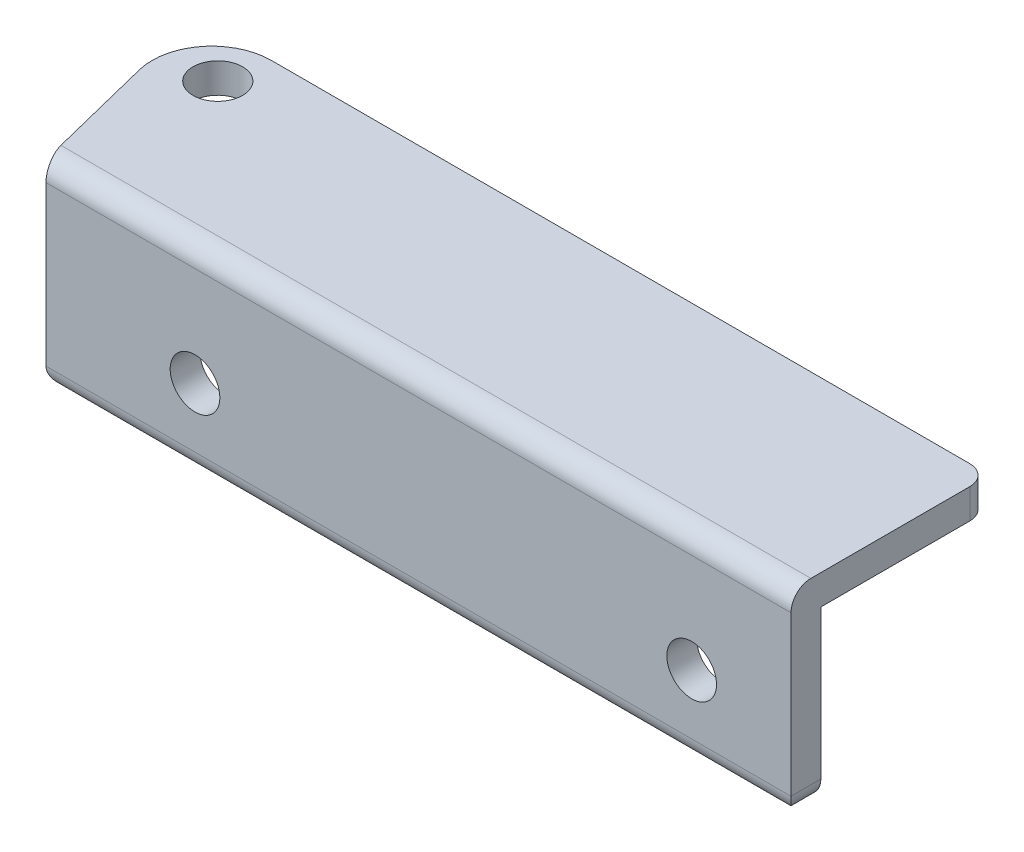
ISO-10303-21;
HEADER;
FILE_DESCRIPTION(('STEP AP214'),'2;1');
FILE_NAME('part.step','',(''),(''),'','','');
FILE_SCHEMA(('AUTOMOTIVE_DESIGN { 1 0 10303 214 1 1 1 1 }'));
ENDSEC;
DATA;
#1=APPLICATION_CONTEXT('core data for automotive mechanical design processes');
#2=APPLICATION_PROTOCOL_DEFINITION('international standard','automotive_design',2000,#1);
#3=PRODUCT_CONTEXT('',#1,'mechanical');
#4=PRODUCT('Part','Part','',(#3));
#5=PRODUCT_RELATED_PRODUCT_CATEGORY('part','',(#4));
#6=PRODUCT_DEFINITION_FORMATION('','',#4);
#7=PRODUCT_DEFINITION_CONTEXT('part definition',#1,'design');
#8=PRODUCT_DEFINITION('design','',#6,#7);
#9=PRODUCT_DEFINITION_SHAPE('','',#8);
#10=(LENGTH_UNIT() NAMED_UNIT(*) SI_UNIT(.MILLI.,.METRE.));
#11=(NAMED_UNIT(*) PLANE_ANGLE_UNIT() SI_UNIT($,.RADIAN.));
#12=(NAMED_UNIT(*) SI_UNIT($,.STERADIAN.) SOLID_ANGLE_UNIT());
#13=UNCERTAINTY_MEASURE_WITH_UNIT(LENGTH_MEASURE(1.E-05),#10,'distance_accuracy_value','');
#14=(GEOMETRIC_REPRESENTATION_CONTEXT(3) GLOBAL_UNCERTAINTY_ASSIGNED_CONTEXT((#13)) GLOBAL_UNIT_ASSIGNED_CONTEXT((#10,
#11,#12)) REPRESENTATION_CONTEXT('',''));
#15=CARTESIAN_POINT('',(0.,0.,0.));
#16=DIRECTION('',(0.,0.,1.));
#17=DIRECTION('',(1.,0.,0.));
#18=AXIS2_PLACEMENT_3D('',#15,#16,#17);
#19=CARTESIAN_POINT('',(0.,20.,0.));
#20=DIRECTION('',(1.,0.,0.));
#21=DIRECTION('',(0.,0.,1.));
#22=AXIS2_PLACEMENT_3D('',#19,#20,#21);
#23=PLANE('',#22);
#24=DIRECTION('',(0.,-1.,0.));
#25=VECTOR('',#24,1.);
#26=CARTESIAN_POINT('',(0.,20.,3.));
#27=LINE('',#26,#25);
#28=CARTESIAN_POINT('',(0.,17.,3.));
#29=VERTEX_POINT('',#28);
#30=CARTESIAN_POINT('',(0.,2.,3.));
#31=VERTEX_POINT('',#30);
#32=EDGE_CURVE('E168',#29,#31,#27,.T.);
#33=ORIENTED_EDGE('',*,*,#32,.F.);
#34=DIRECTION('',(0.,0.,-1.));
#35=VECTOR('',#34,1.);
#36=CARTESIAN_POINT('',(0.,17.,0.));
#37=LINE('',#36,#35);
#38=CARTESIAN_POINT('',(0.,17.,0.));
#39=VERTEX_POINT('',#38);
#40=EDGE_CURVE('E151',#29,#39,#37,.T.);
#41=ORIENTED_EDGE('',*,*,#40,.T.);
#42=DIRECTION('',(0.,-1.,0.));
#43=VECTOR('',#42,1.);
#44=CARTESIAN_POINT('',(0.,20.,0.));
#45=LINE('',#44,#43);
#46=CARTESIAN_POINT('',(0.,2.,0.));
#47=VERTEX_POINT('',#46);
#48=EDGE_CURVE('E145',#39,#47,#45,.T.);
#49=ORIENTED_EDGE('',*,*,#48,.T.);
#50=DIRECTION('',(0.,0.,-1.));
#51=VECTOR('',#50,1.);
#52=CARTESIAN_POINT('',(0.,2.,0.));
#53=LINE('',#52,#51);
#54=EDGE_CURVE('E212',#31,#47,#53,.T.);
#55=ORIENTED_EDGE('',*,*,#54,.F.);
#56=EDGE_LOOP('',(#33,#41,#49,#55));
#57=FACE_BOUND('',#56,.T.);
#58=ADVANCED_FACE('F39',(#57),#23,.F.);
#59=CARTESIAN_POINT('',(0.,20.,0.));
#60=DIRECTION('',(0.,0.,1.));
#61=DIRECTION('',(-1.,0.,0.));
#62=AXIS2_PLACEMENT_3D('',#59,#60,#61);
#63=PLANE('',#62);
#64=CARTESIAN_POINT('',(65.,8.,0.));
#65=DIRECTION('',(0.,0.,1.));
#66=DIRECTION('',(1.,0.,0.));
#67=AXIS2_PLACEMENT_3D('',#64,#65,#66);
#68=CIRCLE('',#67,2.49999999999999);
#69=CARTESIAN_POINT('',(67.5,8.,0.));
#70=VERTEX_POINT('',#69);
#71=EDGE_CURVE('E259',#70,#70,#68,.T.);
#72=ORIENTED_EDGE('',*,*,#71,.T.);
#73=EDGE_LOOP('',(#72));
#74=FACE_BOUND('',#73,.T.);
#75=CARTESIAN_POINT('',(15.,8.,0.));
#76=DIRECTION('',(0.,0.,1.));
#77=DIRECTION('',(1.,0.,0.));
#78=AXIS2_PLACEMENT_3D('',#75,#76,#77);
#79=CIRCLE('',#78,2.5);
#80=CARTESIAN_POINT('',(17.5,8.,0.));
#81=VERTEX_POINT('',#80);
#82=EDGE_CURVE('E256',#81,#81,#79,.T.);
#83=ORIENTED_EDGE('',*,*,#82,.T.);
#84=EDGE_LOOP('',(#83));
#85=FACE_BOUND('',#84,.T.);
#86=ORIENTED_EDGE('',*,*,#48,.F.);
#87=DIRECTION('',(1.,0.,0.));
#88=VECTOR('',#87,1.);
#89=CARTESIAN_POINT('',(0.,17.,0.));
#90=LINE('',#89,#88);
#91=CARTESIAN_POINT('',(75.,17.,0.));
#92=VERTEX_POINT('',#91);
#93=EDGE_CURVE('E131',#39,#92,#90,.T.);
#94=ORIENTED_EDGE('',*,*,#93,.T.);
#95=DIRECTION('',(0.,-1.,0.));
#96=VECTOR('',#95,1.);
#97=CARTESIAN_POINT('',(75.,20.,0.));
#98=LINE('',#97,#96);
#99=CARTESIAN_POINT('',(75.,2.,0.));
#100=VERTEX_POINT('',#99);
#101=EDGE_CURVE('E138',#92,#100,#98,.T.);
#102=ORIENTED_EDGE('',*,*,#101,.T.);
#103=CARTESIAN_POINT('',(73.,2.,0.));
#104=DIRECTION('',(0.,0.,-1.));
#105=DIRECTION('',(-1.,0.,0.));
#106=AXIS2_PLACEMENT_3D('',#103,#104,#105);
#107=CIRCLE('',#106,2.);
#108=CARTESIAN_POINT('',(73.,0.,0.));
#109=VERTEX_POINT('',#108);
#110=EDGE_CURVE('E214',#109,#100,#107,.F.);
#111=ORIENTED_EDGE('',*,*,#110,.F.);
#112=DIRECTION('',(1.,0.,0.));
#113=VECTOR('',#112,1.);
#114=CARTESIAN_POINT('',(0.,0.,0.));
#115=LINE('',#114,#113);
#116=CARTESIAN_POINT('',(2.,0.,0.));
#117=VERTEX_POINT('',#116);
#118=EDGE_CURVE('E153',#117,#109,#115,.T.);
#119=ORIENTED_EDGE('',*,*,#118,.F.);
#120=CARTESIAN_POINT('',(2.,2.,0.));
#121=DIRECTION('',(0.,0.,-1.));
#122=DIRECTION('',(-1.,0.,0.));
#123=AXIS2_PLACEMENT_3D('',#120,#121,#122);
#124=CIRCLE('',#123,2.);
#125=EDGE_CURVE('E62',#47,#117,#124,.F.);
#126=ORIENTED_EDGE('',*,*,#125,.F.);
#127=EDGE_LOOP('',(#86,#94,#102,#111,#119,#126));
#128=FACE_BOUND('',#127,.T.);
#129=ADVANCED_FACE('F148',(#74,#85,#128),#63,.F.);
#130=CARTESIAN_POINT('',(75.,20.,0.));
#131=DIRECTION('',(-1.,0.,0.));
#132=DIRECTION('',(0.,0.,-1.));
#133=AXIS2_PLACEMENT_3D('',#130,#131,#132);
#134=PLANE('',#133);
#135=DIRECTION('',(0.,-1.,0.));
#136=VECTOR('',#135,1.);
#137=CARTESIAN_POINT('',(75.,20.,3.));
#138=LINE('',#137,#136);
#139=CARTESIAN_POINT('',(75.,18.,3.));
#140=VERTEX_POINT('',#139);
#141=CARTESIAN_POINT('',(75.,2.,3.));
#142=VERTEX_POINT('',#141);
#143=EDGE_CURVE('E146',#140,#142,#138,.T.);
#144=ORIENTED_EDGE('',*,*,#143,.T.);
#145=DIRECTION('',(0.,0.,1.));
#146=VECTOR('',#145,1.);
#147=CARTESIAN_POINT('',(75.,2.,3.));
#148=LINE('',#147,#146);
#149=EDGE_CURVE('E142',#100,#142,#148,.T.);
#150=ORIENTED_EDGE('',*,*,#149,.F.);
#151=ORIENTED_EDGE('',*,*,#101,.F.);
#152=DIRECTION('',(0.,0.,-1.));
#153=VECTOR('',#152,1.);
#154=CARTESIAN_POINT('',(75.,17.,0.));
#155=LINE('',#154,#153);
#156=CARTESIAN_POINT('',(75.,17.,-15.));
#157=VERTEX_POINT('',#156);
#158=EDGE_CURVE('E126',#92,#157,#155,.T.);
#159=ORIENTED_EDGE('',*,*,#158,.T.);
#160=DIRECTION('',(0.,1.,0.));
#161=VECTOR('',#160,1.);
#162=CARTESIAN_POINT('',(75.,17.,-15.));
#163=LINE('',#162,#161);
#164=CARTESIAN_POINT('',(75.,20.,-15.));
#165=VERTEX_POINT('',#164);
#166=EDGE_CURVE('E206',#165,#157,#163,.F.);
#167=ORIENTED_EDGE('',*,*,#166,.F.);
#168=DIRECTION('',(0.,0.,1.));
#169=VECTOR('',#168,1.);
#170=CARTESIAN_POINT('',(75.,20.,0.));
#171=LINE('',#170,#169);
#172=CARTESIAN_POINT('',(75.,20.,1.));
#173=VERTEX_POINT('',#172);
#174=EDGE_CURVE('E165',#165,#173,#171,.T.);
#175=ORIENTED_EDGE('',*,*,#174,.T.);
#176=CARTESIAN_POINT('',(75.,18.,1.));
#177=DIRECTION('',(1.,0.,0.));
#178=DIRECTION('',(0.,0.,-1.));
#179=AXIS2_PLACEMENT_3D('',#176,#177,#178);
#180=CIRCLE('',#179,2.);
#181=EDGE_CURVE('E209',#140,#173,#180,.F.);
#182=ORIENTED_EDGE('',*,*,#181,.F.);
#183=EDGE_LOOP('',(#144,#150,#151,#159,#167,#175,#182));
#184=FACE_BOUND('',#183,.T.);
#185=ADVANCED_FACE('F140',(#184),#134,.F.);
#186=CARTESIAN_POINT('',(0.,20.,3.));
#187=DIRECTION('',(0.,0.,-1.));
#188=DIRECTION('',(1.,0.,0.));
#189=AXIS2_PLACEMENT_3D('',#186,#187,#188);
#190=PLANE('',#189);
#191=CARTESIAN_POINT('',(65.,8.,3.));
#192=DIRECTION('',(0.,0.,1.));
#193=DIRECTION('',(1.,0.,0.));
#194=AXIS2_PLACEMENT_3D('',#191,#192,#193);
#195=CIRCLE('',#194,2.49999999999999);
#196=CARTESIAN_POINT('',(67.5,8.,3.));
#197=VERTEX_POINT('',#196);
#198=EDGE_CURVE('E252',#197,#197,#195,.T.);
#199=ORIENTED_EDGE('',*,*,#198,.F.);
#200=EDGE_LOOP('',(#199));
#201=FACE_BOUND('',#200,.T.);
#202=CARTESIAN_POINT('',(15.,8.,3.));
#203=DIRECTION('',(0.,0.,1.));
#204=DIRECTION('',(1.,0.,0.));
#205=AXIS2_PLACEMENT_3D('',#202,#203,#204);
#206=CIRCLE('',#205,2.5);
#207=CARTESIAN_POINT('',(17.5,8.,3.));
#208=VERTEX_POINT('',#207);
#209=EDGE_CURVE('E253',#208,#208,#206,.T.);
#210=ORIENTED_EDGE('',*,*,#209,.F.);
#211=EDGE_LOOP('',(#210));
#212=FACE_BOUND('',#211,.T.);
#213=ORIENTED_EDGE('',*,*,#143,.F.);
#214=DIRECTION('',(-1.,0.,0.));
#215=VECTOR('',#214,1.);
#216=CARTESIAN_POINT('',(0.,18.,3.));
#217=LINE('',#216,#215);
#218=CARTESIAN_POINT('',(0.,18.,3.));
#219=VERTEX_POINT('',#218);
#220=EDGE_CURVE('E186',#219,#140,#217,.F.);
#221=ORIENTED_EDGE('',*,*,#220,.F.);
#222=EDGE_CURVE('E171',#219,#29,#27,.T.);
#223=ORIENTED_EDGE('',*,*,#222,.T.);
#224=ORIENTED_EDGE('',*,*,#32,.T.);
#225=DIRECTION('',(-1.,0.,0.));
#226=VECTOR('',#225,1.);
#227=CARTESIAN_POINT('',(0.,2.,3.));
#228=LINE('',#227,#226);
#229=EDGE_CURVE('E188',#142,#31,#228,.T.);
#230=ORIENTED_EDGE('',*,*,#229,.F.);
#231=EDGE_LOOP('',(#213,#221,#223,#224,#230));
#232=FACE_BOUND('',#231,.T.);
#233=ADVANCED_FACE('F268',(#201,#212,#232),#190,.F.);
#234=CARTESIAN_POINT('',(0.,20.,0.));
#235=DIRECTION('',(0.,-1.,0.));
#236=DIRECTION('',(0.,0.,1.));
#237=AXIS2_PLACEMENT_3D('',#234,#235,#236);
#238=PLANE('',#237);
#239=CARTESIAN_POINT('',(1.79427023522428,20.,-12.5));
#240=DIRECTION('',(0.,-1.,0.));
#241=DIRECTION('',(0.,0.,-1.));
#242=AXIS2_PLACEMENT_3D('',#239,#240,#241);
#243=CIRCLE('',#242,2.5);
#244=CARTESIAN_POINT('',(1.79427023522428,20.,-15.));
#245=VERTEX_POINT('',#244);
#246=EDGE_CURVE('E249',#245,#245,#243,.T.);
#247=ORIENTED_EDGE('',*,*,#246,.T.);
#248=EDGE_LOOP('',(#247));
#249=FACE_BOUND('',#248,.T.);
#250=ORIENTED_EDGE('',*,*,#174,.F.);
#251=CARTESIAN_POINT('',(73.,20.,-15.));
#252=DIRECTION('',(0.,1.,0.));
#253=DIRECTION('',(0.,0.,1.));
#254=AXIS2_PLACEMENT_3D('',#251,#252,#253);
#255=CIRCLE('',#254,2.);
#256=CARTESIAN_POINT('',(73.,20.,-17.));
#257=VERTEX_POINT('',#256);
#258=EDGE_CURVE('E199',#257,#165,#255,.F.);
#259=ORIENTED_EDGE('',*,*,#258,.F.);
#260=DIRECTION('',(1.,0.,0.));
#261=VECTOR('',#260,1.);
#262=CARTESIAN_POINT('',(0.,20.,-17.));
#263=LINE('',#262,#261);
#264=CARTESIAN_POINT('',(2.68465843842649,20.,-17.));
#265=VERTEX_POINT('',#264);
#266=EDGE_CURVE('E160',#265,#257,#263,.T.);
#267=ORIENTED_EDGE('',*,*,#266,.F.);
#268=CARTESIAN_POINT('',(2.68465843842649,20.,-11.));
#269=DIRECTION('',(0.,1.,0.));
#270=DIRECTION('',(0.,0.,1.));
#271=AXIS2_PLACEMENT_3D('',#268,#269,#270);
#272=CIRCLE('',#271,6.);
#273=CARTESIAN_POINT('',(-3.1361965624455,20.,-9.544786249782));
#274=VERTEX_POINT('',#273);
#275=EDGE_CURVE('E178',#274,#265,#272,.F.);
#276=ORIENTED_EDGE('',*,*,#275,.F.);
#277=DIRECTION('',(-0.242535625036333,0.,-0.970142500145332));
#278=VECTOR('',#277,1.);
#279=CARTESIAN_POINT('',(-0.705882352941176,20.,0.176470588235294));
#280=LINE('',#279,#278);
#281=CARTESIAN_POINT('',(-0.5,20.,1.));
#282=VERTEX_POINT('',#281);
#283=EDGE_CURVE('E157',#282,#274,#280,.T.);
#284=ORIENTED_EDGE('',*,*,#283,.F.);
#285=DIRECTION('',(-1.,0.,0.));
#286=VECTOR('',#285,1.);
#287=CARTESIAN_POINT('',(0.,20.,1.));
#288=LINE('',#287,#286);
#289=EDGE_CURVE('E201',#173,#282,#288,.T.);
#290=ORIENTED_EDGE('',*,*,#289,.F.);
#291=EDGE_LOOP('',(#250,#259,#267,#276,#284,#290));
#292=FACE_BOUND('',#291,.T.);
#293=ADVANCED_FACE('F271',(#249,#292),#238,.F.);
#294=CARTESIAN_POINT('',(0.,0.,0.));
#295=DIRECTION('',(0.,-1.,0.));
#296=DIRECTION('',(0.,0.,1.));
#297=AXIS2_PLACEMENT_3D('',#294,#295,#296);
#298=PLANE('',#297);
#299=ORIENTED_EDGE('',*,*,#118,.T.);
#300=DIRECTION('',(0.,0.,1.));
#301=VECTOR('',#300,1.);
#302=CARTESIAN_POINT('',(73.,0.,0.));
#303=LINE('',#302,#301);
#304=CARTESIAN_POINT('',(73.,0.,1.));
#305=VERTEX_POINT('',#304);
#306=EDGE_CURVE('E191',#305,#109,#303,.F.);
#307=ORIENTED_EDGE('',*,*,#306,.F.);
#308=DIRECTION('',(-1.,0.,0.));
#309=VECTOR('',#308,1.);
#310=CARTESIAN_POINT('',(75.,0.,1.));
#311=LINE('',#310,#309);
#312=CARTESIAN_POINT('',(2.,0.,1.));
#313=VERTEX_POINT('',#312);
#314=EDGE_CURVE('E193',#313,#305,#311,.F.);
#315=ORIENTED_EDGE('',*,*,#314,.F.);
#316=DIRECTION('',(0.,0.,-1.));
#317=VECTOR('',#316,1.);
#318=CARTESIAN_POINT('',(2.,0.,3.));
#319=LINE('',#318,#317);
#320=EDGE_CURVE('E196',#117,#313,#319,.F.);
#321=ORIENTED_EDGE('',*,*,#320,.F.);
#322=EDGE_LOOP('',(#299,#307,#315,#321));
#323=FACE_BOUND('',#322,.T.);
#324=ADVANCED_FACE('F227',(#323),#298,.T.);
#325=CARTESIAN_POINT('',(-0.705882352941176,17.,0.176470588235294));
#326=DIRECTION('',(-0.970142500145332,0.,0.242535625036333));
#327=DIRECTION('',(-0.242535625036333,0.,-0.970142500145332));
#328=AXIS2_PLACEMENT_3D('',#325,#326,#327);
#329=PLANE('',#328);
#330=ORIENTED_EDGE('',*,*,#283,.T.);
#331=DIRECTION('',(0.,1.,0.));
#332=VECTOR('',#331,1.);
#333=CARTESIAN_POINT('',(-3.1361965624455,17.,-9.544786249782));
#334=LINE('',#333,#332);
#335=CARTESIAN_POINT('',(-3.1361965624455,17.,-9.544786249782));
#336=VERTEX_POINT('',#335);
#337=EDGE_CURVE('E176',#336,#274,#334,.T.);
#338=ORIENTED_EDGE('',*,*,#337,.F.);
#339=DIRECTION('',(-0.242535625036333,0.,-0.970142500145332));
#340=VECTOR('',#339,1.);
#341=CARTESIAN_POINT('',(-0.705882352941176,17.,0.176470588235294));
#342=LINE('',#341,#340);
#343=EDGE_CURVE('E164',#29,#336,#342,.T.);
#344=ORIENTED_EDGE('',*,*,#343,.F.);
#345=ORIENTED_EDGE('',*,*,#222,.F.);
#346=CARTESIAN_POINT('',(-0.5,18.,1.));
#347=DIRECTION('',(0.970142500145332,0.,-0.242535625036333));
#348=DIRECTION('',(-0.242535625036333,0.,-0.970142500145332));
#349=AXIS2_PLACEMENT_3D('',#346,#347,#348);
#350=ELLIPSE('',#349,2.06155281280883,2.);
#351=EDGE_CURVE('E204',#282,#219,#350,.T.);
#352=ORIENTED_EDGE('',*,*,#351,.F.);
#353=EDGE_LOOP('',(#330,#338,#344,#345,#352));
#354=FACE_BOUND('',#353,.T.);
#355=ADVANCED_FACE('F239',(#354),#329,.T.);
#356=CARTESIAN_POINT('',(0.,17.,-17.));
#357=DIRECTION('',(0.,0.,-1.));
#358=DIRECTION('',(1.,0.,0.));
#359=AXIS2_PLACEMENT_3D('',#356,#357,#358);
#360=PLANE('',#359);
#361=DIRECTION('',(1.,0.,0.));
#362=VECTOR('',#361,1.);
#363=CARTESIAN_POINT('',(0.,17.,-17.));
#364=LINE('',#363,#362);
#365=CARTESIAN_POINT('',(2.68465843842649,17.,-17.));
#366=VERTEX_POINT('',#365);
#367=CARTESIAN_POINT('',(73.,17.,-17.));
#368=VERTEX_POINT('',#367);
#369=EDGE_CURVE('E135',#366,#368,#364,.T.);
#370=ORIENTED_EDGE('',*,*,#369,.F.);
#371=DIRECTION('',(0.,1.,0.));
#372=VECTOR('',#371,1.);
#373=CARTESIAN_POINT('',(2.68465843842649,17.,-17.));
#374=LINE('',#373,#372);
#375=EDGE_CURVE('E181',#265,#366,#374,.F.);
#376=ORIENTED_EDGE('',*,*,#375,.F.);
#377=ORIENTED_EDGE('',*,*,#266,.T.);
#378=DIRECTION('',(0.,1.,0.));
#379=VECTOR('',#378,1.);
#380=CARTESIAN_POINT('',(73.,20.,-17.));
#381=LINE('',#380,#379);
#382=EDGE_CURVE('E48',#368,#257,#381,.T.);
#383=ORIENTED_EDGE('',*,*,#382,.F.);
#384=EDGE_LOOP('',(#370,#376,#377,#383));
#385=FACE_BOUND('',#384,.T.);
#386=ADVANCED_FACE('F247',(#385),#360,.T.);
#387=CARTESIAN_POINT('',(0.,17.,0.));
#388=DIRECTION('',(0.,1.,0.));
#389=DIRECTION('',(0.,0.,-1.));
#390=AXIS2_PLACEMENT_3D('',#387,#388,#389);
#391=PLANE('',#390);
#392=CARTESIAN_POINT('',(1.79427023522428,17.,-12.5));
#393=DIRECTION('',(0.,-1.,0.));
#394=DIRECTION('',(0.,0.,-1.));
#395=AXIS2_PLACEMENT_3D('',#392,#393,#394);
#396=CIRCLE('',#395,2.5);
#397=CARTESIAN_POINT('',(1.79427023522428,17.,-15.));
#398=VERTEX_POINT('',#397);
#399=EDGE_CURVE('E43',#398,#398,#396,.T.);
#400=ORIENTED_EDGE('',*,*,#399,.F.);
#401=EDGE_LOOP('',(#400));
#402=FACE_BOUND('',#401,.T.);
#403=ORIENTED_EDGE('',*,*,#158,.F.);
#404=ORIENTED_EDGE('',*,*,#93,.F.);
#405=ORIENTED_EDGE('',*,*,#40,.F.);
#406=ORIENTED_EDGE('',*,*,#343,.T.);
#407=CARTESIAN_POINT('',(2.68465843842649,17.,-11.));
#408=DIRECTION('',(0.,-1.,0.));
#409=DIRECTION('',(0.,0.,-1.));
#410=AXIS2_PLACEMENT_3D('',#407,#408,#409);
#411=CIRCLE('',#410,6.);
#412=EDGE_CURVE('E184',#366,#336,#411,.F.);
#413=ORIENTED_EDGE('',*,*,#412,.F.);
#414=ORIENTED_EDGE('',*,*,#369,.T.);
#415=CARTESIAN_POINT('',(73.,17.,-15.));
#416=DIRECTION('',(0.,-1.,0.));
#417=DIRECTION('',(0.,0.,-1.));
#418=AXIS2_PLACEMENT_3D('',#415,#416,#417);
#419=CIRCLE('',#418,2.);
#420=EDGE_CURVE('E11',#157,#368,#419,.F.);
#421=ORIENTED_EDGE('',*,*,#420,.F.);
#422=EDGE_LOOP('',(#403,#404,#405,#406,#413,#414,#421));
#423=FACE_BOUND('',#422,.T.);
#424=ADVANCED_FACE('F128',(#402,#423),#391,.F.);
#425=CARTESIAN_POINT('',(2.68465843842649,17.,-11.));
#426=DIRECTION('',(0.,1.,0.));
#427=DIRECTION('',(0.,0.,-1.));
#428=AXIS2_PLACEMENT_3D('',#425,#426,#427);
#429=CYLINDRICAL_SURFACE('',#428,6.);
#430=ORIENTED_EDGE('',*,*,#412,.T.);
#431=ORIENTED_EDGE('',*,*,#337,.T.);
#432=ORIENTED_EDGE('',*,*,#275,.T.);
#433=ORIENTED_EDGE('',*,*,#375,.T.);
#434=EDGE_LOOP('',(#430,#431,#432,#433));
#435=FACE_BOUND('',#434,.T.);
#436=ADVANCED_FACE('F243',(#435),#429,.T.);
#437=CARTESIAN_POINT('',(73.,2.,0.));
#438=DIRECTION('',(0.,0.,-1.));
#439=DIRECTION('',(1.,0.,0.));
#440=AXIS2_PLACEMENT_3D('',#437,#438,#439);
#441=CYLINDRICAL_SURFACE('',#440,2.);
#442=ORIENTED_EDGE('',*,*,#110,.T.);
#443=ORIENTED_EDGE('',*,*,#149,.T.);
#444=CARTESIAN_POINT('',(73.,2.,1.));
#445=DIRECTION('',(-0.707106781186547,0.,0.707106781186547));
#446=DIRECTION('',(-0.707106781186547,0.,-0.707106781186547));
#447=AXIS2_PLACEMENT_3D('',#444,#445,#446);
#448=ELLIPSE('',#447,2.82842712474619,2.);
#449=EDGE_CURVE('E161',#142,#305,#448,.F.);
#450=ORIENTED_EDGE('',*,*,#449,.T.);
#451=ORIENTED_EDGE('',*,*,#306,.T.);
#452=EDGE_LOOP('',(#442,#443,#450,#451));
#453=FACE_BOUND('',#452,.T.);
#454=ADVANCED_FACE('F220',(#453),#441,.T.);
#455=CARTESIAN_POINT('',(2.,2.,0.));
#456=DIRECTION('',(0.,0.,1.));
#457=DIRECTION('',(-1.,0.,0.));
#458=AXIS2_PLACEMENT_3D('',#455,#456,#457);
#459=CYLINDRICAL_SURFACE('',#458,2.);
#460=ORIENTED_EDGE('',*,*,#125,.T.);
#461=ORIENTED_EDGE('',*,*,#320,.T.);
#462=CARTESIAN_POINT('',(2.,2.,1.));
#463=DIRECTION('',(-0.707106781186547,0.,-0.707106781186547));
#464=DIRECTION('',(-0.707106781186547,0.,0.707106781186547));
#465=AXIS2_PLACEMENT_3D('',#462,#463,#464);
#466=ELLIPSE('',#465,2.82842712474619,2.);
#467=EDGE_CURVE('E218',#313,#31,#466,.T.);
#468=ORIENTED_EDGE('',*,*,#467,.T.);
#469=ORIENTED_EDGE('',*,*,#54,.T.);
#470=EDGE_LOOP('',(#460,#461,#468,#469));
#471=FACE_BOUND('',#470,.T.);
#472=ADVANCED_FACE('F229',(#471),#459,.T.);
#473=CARTESIAN_POINT('',(0.,2.,1.));
#474=DIRECTION('',(1.,0.,0.));
#475=DIRECTION('',(0.,0.,1.));
#476=AXIS2_PLACEMENT_3D('',#473,#474,#475);
#477=CYLINDRICAL_SURFACE('',#476,2.);
#478=ORIENTED_EDGE('',*,*,#449,.F.);
#479=ORIENTED_EDGE('',*,*,#229,.T.);
#480=ORIENTED_EDGE('',*,*,#467,.F.);
#481=ORIENTED_EDGE('',*,*,#314,.T.);
#482=EDGE_LOOP('',(#478,#479,#480,#481));
#483=FACE_BOUND('',#482,.T.);
#484=ADVANCED_FACE('F225',(#483),#477,.T.);
#485=CARTESIAN_POINT('',(0.,18.,1.));
#486=DIRECTION('',(-1.,0.,0.));
#487=DIRECTION('',(0.,0.,-1.));
#488=AXIS2_PLACEMENT_3D('',#485,#486,#487);
#489=CYLINDRICAL_SURFACE('',#488,2.);
#490=ORIENTED_EDGE('',*,*,#181,.T.);
#491=ORIENTED_EDGE('',*,*,#289,.T.);
#492=ORIENTED_EDGE('',*,*,#351,.T.);
#493=ORIENTED_EDGE('',*,*,#220,.T.);
#494=EDGE_LOOP('',(#490,#491,#492,#493));
#495=FACE_BOUND('',#494,.T.);
#496=ADVANCED_FACE('F280',(#495),#489,.T.);
#497=CARTESIAN_POINT('',(73.,17.,-15.));
#498=DIRECTION('',(0.,-1.,0.));
#499=DIRECTION('',(0.,0.,1.));
#500=AXIS2_PLACEMENT_3D('',#497,#498,#499);
#501=CYLINDRICAL_SURFACE('',#500,2.);
#502=ORIENTED_EDGE('',*,*,#420,.T.);
#503=ORIENTED_EDGE('',*,*,#382,.T.);
#504=ORIENTED_EDGE('',*,*,#258,.T.);
#505=ORIENTED_EDGE('',*,*,#166,.T.);
#506=EDGE_LOOP('',(#502,#503,#504,#505));
#507=FACE_BOUND('',#506,.T.);
#508=ADVANCED_FACE('F41',(#507),#501,.T.);
#509=CARTESIAN_POINT('',(1.79427023522428,0.,-12.5));
#510=DIRECTION('',(0.,1.,0.));
#511=DIRECTION('',(0.,0.,-1.));
#512=AXIS2_PLACEMENT_3D('',#509,#510,#511);
#513=CYLINDRICAL_SURFACE('',#512,2.5);
#514=ORIENTED_EDGE('',*,*,#246,.F.);
#515=EDGE_LOOP('',(#514));
#516=FACE_BOUND('',#515,.T.);
#517=ORIENTED_EDGE('',*,*,#399,.T.);
#518=EDGE_LOOP('',(#517));
#519=FACE_BOUND('',#518,.T.);
#520=ADVANCED_FACE('F284',(#516,#519),#513,.F.);
#521=CARTESIAN_POINT('',(15.,8.,3.));
#522=DIRECTION('',(0.,0.,-1.));
#523=DIRECTION('',(1.,0.,0.));
#524=AXIS2_PLACEMENT_3D('',#521,#522,#523);
#525=CYLINDRICAL_SURFACE('',#524,2.5);
#526=CARTESIAN_POINT('',(17.5,8.,3.));
#527=CARTESIAN_POINT('',(17.5,8.,2.96875));
#528=CARTESIAN_POINT('',(17.5,8.,2.9375));
#529=CARTESIAN_POINT('',(17.5,8.,2.875));
#530=CARTESIAN_POINT('',(17.5,8.,2.84375));
#531=CARTESIAN_POINT('',(17.5,8.,2.78125));
#532=CARTESIAN_POINT('',(17.5,8.,2.75));
#533=CARTESIAN_POINT('',(17.5,8.,2.6875));
#534=CARTESIAN_POINT('',(17.5,8.,2.65625));
#535=CARTESIAN_POINT('',(17.5,8.,2.59375));
#536=CARTESIAN_POINT('',(17.5,8.,2.5625));
#537=CARTESIAN_POINT('',(17.5,8.,2.5));
#538=CARTESIAN_POINT('',(17.5,8.,2.46875));
#539=CARTESIAN_POINT('',(17.5,8.,2.40625));
#540=CARTESIAN_POINT('',(17.5,8.,2.375));
#541=CARTESIAN_POINT('',(17.5,8.,2.3125));
#542=CARTESIAN_POINT('',(17.5,8.,2.28125));
#543=CARTESIAN_POINT('',(17.5,8.,2.21875));
#544=CARTESIAN_POINT('',(17.5,8.,2.1875));
#545=CARTESIAN_POINT('',(17.5,8.,2.125));
#546=CARTESIAN_POINT('',(17.5,8.,2.09375));
#547=CARTESIAN_POINT('',(17.5,8.,2.03125));
#548=CARTESIAN_POINT('',(17.5,8.,2.));
#549=CARTESIAN_POINT('',(17.5,8.,1.9375));
#550=CARTESIAN_POINT('',(17.5,8.,1.90625));
#551=CARTESIAN_POINT('',(17.5,8.,1.84375));
#552=CARTESIAN_POINT('',(17.5,8.,1.8125));
#553=CARTESIAN_POINT('',(17.5,8.,1.75));
#554=CARTESIAN_POINT('',(17.5,8.,1.71875));
#555=CARTESIAN_POINT('',(17.5,8.,1.65625));
#556=CARTESIAN_POINT('',(17.5,8.,1.625));
#557=CARTESIAN_POINT('',(17.5,8.,1.5625));
#558=CARTESIAN_POINT('',(17.5,8.,1.53125));
#559=CARTESIAN_POINT('',(17.5,8.,1.46875));
#560=CARTESIAN_POINT('',(17.5,8.,1.4375));
#561=CARTESIAN_POINT('',(17.5,8.,1.375));
#562=CARTESIAN_POINT('',(17.5,8.,1.34375));
#563=CARTESIAN_POINT('',(17.5,8.,1.28125));
#564=CARTESIAN_POINT('',(17.5,8.,1.25));
#565=CARTESIAN_POINT('',(17.5,8.,1.1875));
#566=CARTESIAN_POINT('',(17.5,8.,1.15625));
#567=CARTESIAN_POINT('',(17.5,8.,1.09375));
#568=CARTESIAN_POINT('',(17.5,8.,1.0625));
#569=CARTESIAN_POINT('',(17.5,8.,1.));
#570=CARTESIAN_POINT('',(17.5,8.,0.96875));
#571=CARTESIAN_POINT('',(17.5,8.,0.90625));
#572=CARTESIAN_POINT('',(17.5,8.,0.875));
#573=CARTESIAN_POINT('',(17.5,8.,0.8125));
#574=CARTESIAN_POINT('',(17.5,8.,0.78125));
#575=CARTESIAN_POINT('',(17.5,8.,0.71875));
#576=CARTESIAN_POINT('',(17.5,8.,0.6875));
#577=CARTESIAN_POINT('',(17.5,8.,0.625));
#578=CARTESIAN_POINT('',(17.5,8.,0.59375));
#579=CARTESIAN_POINT('',(17.5,8.,0.53125));
#580=CARTESIAN_POINT('',(17.5,8.,0.5));
#581=CARTESIAN_POINT('',(17.5,8.,0.4375));
#582=CARTESIAN_POINT('',(17.5,8.,0.40625));
#583=CARTESIAN_POINT('',(17.5,8.,0.34375));
#584=CARTESIAN_POINT('',(17.5,8.,0.3125));
#585=CARTESIAN_POINT('',(17.5,8.,0.25));
#586=CARTESIAN_POINT('',(17.5,8.,0.21875));
#587=CARTESIAN_POINT('',(17.5,8.,0.15625));
#588=CARTESIAN_POINT('',(17.5,8.,0.125));
#589=CARTESIAN_POINT('',(17.5,8.,0.0625000000000001));
#590=CARTESIAN_POINT('',(17.5,8.,0.03125));
#591=CARTESIAN_POINT('',(17.5,8.,0.));
#592=B_SPLINE_CURVE_WITH_KNOTS('',3,(#526,#527,#528,#529,#530,#531,#532,#533,#534,#535,#536,
#537,#538,#539,#540,#541,#542,#543,#544,#545,#546,#547,#548,#549,#550,#551,#552,#553,#554,#555,
#556,#557,#558,#559,#560,#561,#562,#563,#564,#565,#566,#567,#568,#569,#570,#571,#572,#573,#574,
#575,#576,#577,#578,#579,#580,#581,#582,#583,#584,#585,#586,#587,#588,#589,#590,#591),
.UNSPECIFIED.,.F.,.F.,(4,2,2,2,2,2,2,2,2,2,2,2,2,2,2,2,2,2,2,2,2,2,2,2,2,2,2,2,2,2,2,2,4),(0.,
0.0937499999999997,0.1875,0.28125,0.375,0.46875,0.5625,0.65625,0.75,0.84375,0.9375,1.03125,
1.125,1.21875,1.3125,1.40625,1.5,1.59375,1.6875,1.78125,1.875,1.96875,2.0625,2.15625,2.25,
2.34375,2.4375,2.53125,2.625,2.71875,2.8125,2.90625,3.),.UNSPECIFIED.);
#593=EDGE_CURVE('BSEAM289',#208,#81,#592,.T.);
#594=ORIENTED_EDGE('',*,*,#209,.T.);
#595=ORIENTED_EDGE('',*,*,#82,.F.);
#596=ORIENTED_EDGE('',*,*,#593,.T.);
#597=ORIENTED_EDGE('',*,*,#593,.F.);
#598=EDGE_LOOP('',(#594,#596,#595,#597));
#599=FACE_BOUND('',#598,.T.);
#600=ADVANCED_FACE('F289',(#599),#525,.F.);
#601=CARTESIAN_POINT('',(65.,8.,3.));
#602=DIRECTION('',(0.,0.,-1.));
#603=DIRECTION('',(1.,0.,0.));
#604=AXIS2_PLACEMENT_3D('',#601,#602,#603);
#605=CYLINDRICAL_SURFACE('',#604,2.49999999999999);
#606=CARTESIAN_POINT('',(67.5,8.,3.));
#607=CARTESIAN_POINT('',(67.5,8.,2.96875));
#608=CARTESIAN_POINT('',(67.5,8.,2.9375));
#609=CARTESIAN_POINT('',(67.5,8.,2.875));
#610=CARTESIAN_POINT('',(67.5,8.,2.84375));
#611=CARTESIAN_POINT('',(67.5,8.,2.78125));
#612=CARTESIAN_POINT('',(67.5,8.,2.75));
#613=CARTESIAN_POINT('',(67.5,8.,2.6875));
#614=CARTESIAN_POINT('',(67.5,8.,2.65625));
#615=CARTESIAN_POINT('',(67.5,8.,2.59375));
#616=CARTESIAN_POINT('',(67.5,8.,2.5625));
#617=CARTESIAN_POINT('',(67.5,8.,2.5));
#618=CARTESIAN_POINT('',(67.5,8.,2.46875));
#619=CARTESIAN_POINT('',(67.5,8.,2.40625));
#620=CARTESIAN_POINT('',(67.5,8.,2.375));
#621=CARTESIAN_POINT('',(67.5,8.,2.3125));
#622=CARTESIAN_POINT('',(67.5,8.,2.28125));
#623=CARTESIAN_POINT('',(67.5,8.,2.21875));
#624=CARTESIAN_POINT('',(67.5,8.,2.1875));
#625=CARTESIAN_POINT('',(67.5,8.,2.125));
#626=CARTESIAN_POINT('',(67.5,8.,2.09375));
#627=CARTESIAN_POINT('',(67.5,8.,2.03125));
#628=CARTESIAN_POINT('',(67.5,8.,2.));
#629=CARTESIAN_POINT('',(67.5,8.,1.9375));
#630=CARTESIAN_POINT('',(67.5,8.,1.90625));
#631=CARTESIAN_POINT('',(67.5,8.,1.84375));
#632=CARTESIAN_POINT('',(67.5,8.,1.8125));
#633=CARTESIAN_POINT('',(67.5,8.,1.75));
#634=CARTESIAN_POINT('',(67.5,8.,1.71875));
#635=CARTESIAN_POINT('',(67.5,8.,1.65625));
#636=CARTESIAN_POINT('',(67.5,8.,1.625));
#637=CARTESIAN_POINT('',(67.5,8.,1.5625));
#638=CARTESIAN_POINT('',(67.5,8.,1.53125));
#639=CARTESIAN_POINT('',(67.5,8.,1.46875));
#640=CARTESIAN_POINT('',(67.5,8.,1.4375));
#641=CARTESIAN_POINT('',(67.5,8.,1.375));
#642=CARTESIAN_POINT('',(67.5,8.,1.34375));
#643=CARTESIAN_POINT('',(67.5,8.,1.28125));
#644=CARTESIAN_POINT('',(67.5,8.,1.25));
#645=CARTESIAN_POINT('',(67.5,8.,1.1875));
#646=CARTESIAN_POINT('',(67.5,8.,1.15625));
#647=CARTESIAN_POINT('',(67.5,8.,1.09375));
#648=CARTESIAN_POINT('',(67.5,8.,1.0625));
#649=CARTESIAN_POINT('',(67.5,8.,1.));
#650=CARTESIAN_POINT('',(67.5,8.,0.96875));
#651=CARTESIAN_POINT('',(67.5,8.,0.90625));
#652=CARTESIAN_POINT('',(67.5,8.,0.875));
#653=CARTESIAN_POINT('',(67.5,8.,0.8125));
#654=CARTESIAN_POINT('',(67.5,8.,0.78125));
#655=CARTESIAN_POINT('',(67.5,8.,0.71875));
#656=CARTESIAN_POINT('',(67.5,8.,0.6875));
#657=CARTESIAN_POINT('',(67.5,8.,0.625));
#658=CARTESIAN_POINT('',(67.5,8.,0.59375));
#659=CARTESIAN_POINT('',(67.5,8.,0.53125));
#660=CARTESIAN_POINT('',(67.5,8.,0.5));
#661=CARTESIAN_POINT('',(67.5,8.,0.4375));
#662=CARTESIAN_POINT('',(67.5,8.,0.40625));
#663=CARTESIAN_POINT('',(67.5,8.,0.34375));
#664=CARTESIAN_POINT('',(67.5,8.,0.3125));
#665=CARTESIAN_POINT('',(67.5,8.,0.25));
#666=CARTESIAN_POINT('',(67.5,8.,0.21875));
#667=CARTESIAN_POINT('',(67.5,8.,0.15625));
#668=CARTESIAN_POINT('',(67.5,8.,0.125));
#669=CARTESIAN_POINT('',(67.5,8.,0.0625000000000001));
#670=CARTESIAN_POINT('',(67.5,8.,0.03125));
#671=CARTESIAN_POINT('',(67.5,8.,0.));
#672=B_SPLINE_CURVE_WITH_KNOTS('',3,(#606,#607,#608,#609,#610,#611,#612,#613,#614,#615,#616,
#617,#618,#619,#620,#621,#622,#623,#624,#625,#626,#627,#628,#629,#630,#631,#632,#633,#634,#635,
#636,#637,#638,#639,#640,#641,#642,#643,#644,#645,#646,#647,#648,#649,#650,#651,#652,#653,#654,
#655,#656,#657,#658,#659,#660,#661,#662,#663,#664,#665,#666,#667,#668,#669,#670,#671),
.UNSPECIFIED.,.F.,.F.,(4,2,2,2,2,2,2,2,2,2,2,2,2,2,2,2,2,2,2,2,2,2,2,2,2,2,2,2,2,2,2,2,4),(0.,
0.0937499999999997,0.1875,0.28125,0.375,0.46875,0.5625,0.65625,0.75,0.84375,0.9375,1.03125,
1.125,1.21875,1.3125,1.40625,1.5,1.59375,1.6875,1.78125,1.875,1.96875,2.0625,2.15625,2.25,
2.34375,2.4375,2.53125,2.625,2.71875,2.8125,2.90625,3.),.UNSPECIFIED.);
#673=EDGE_CURVE('BSEAM265',#197,#70,#672,.T.);
#674=ORIENTED_EDGE('',*,*,#198,.T.);
#675=ORIENTED_EDGE('',*,*,#71,.F.);
#676=ORIENTED_EDGE('',*,*,#673,.T.);
#677=ORIENTED_EDGE('',*,*,#673,.F.);
#678=EDGE_LOOP('',(#674,#676,#675,#677));
#679=FACE_BOUND('',#678,.T.);
#680=ADVANCED_FACE('F265',(#679),#605,.F.);
#681=CLOSED_SHELL('',(#58,#129,#185,#233,#293,#324,#355,#386,#424,#436,#454,#472,#484,#496,#508,
#520,#600,#680));
#682=MANIFOLD_SOLID_BREP('B2',#681);
#683=ADVANCED_BREP_SHAPE_REPRESENTATION('',(#18,#682),#14);
#684=SHAPE_DEFINITION_REPRESENTATION(#9,#683);
ENDSEC;
END-ISO-10303-21;
